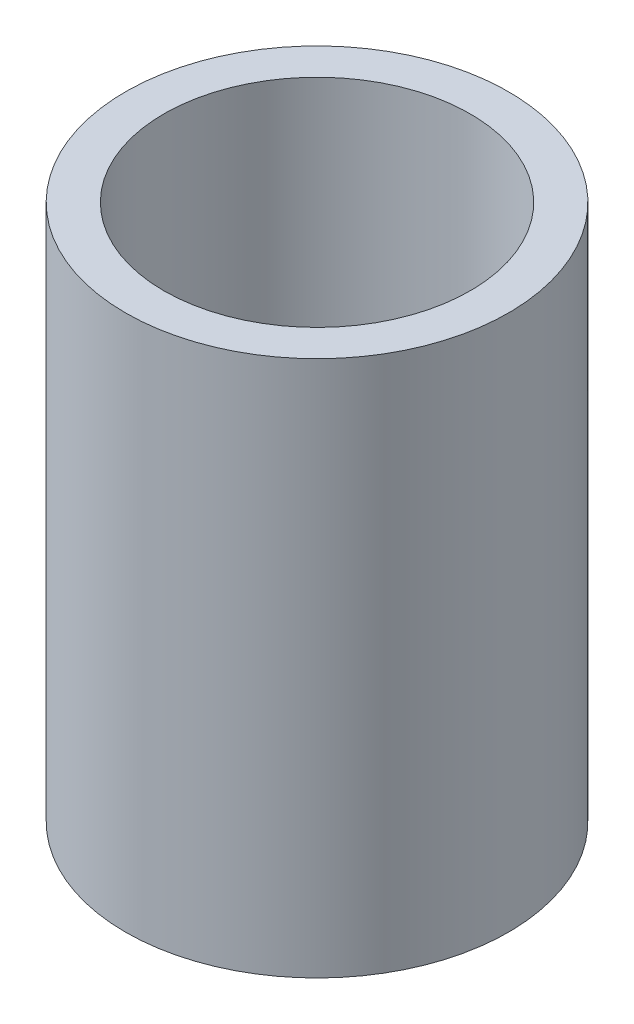
ISO-10303-21;
HEADER;
FILE_DESCRIPTION(('STEP AP214'),'2;1');
FILE_NAME('part.step','',(''),(''),'','','');
FILE_SCHEMA(('AUTOMOTIVE_DESIGN { 1 0 10303 214 1 1 1 1 }'));
ENDSEC;
DATA;
#1=APPLICATION_CONTEXT('core data for automotive mechanical design processes');
#2=APPLICATION_PROTOCOL_DEFINITION('international standard','automotive_design',2000,#1);
#3=PRODUCT_CONTEXT('',#1,'mechanical');
#4=PRODUCT('Part','Part','',(#3));
#5=PRODUCT_RELATED_PRODUCT_CATEGORY('part','',(#4));
#6=PRODUCT_DEFINITION_FORMATION('','',#4);
#7=PRODUCT_DEFINITION_CONTEXT('part definition',#1,'design');
#8=PRODUCT_DEFINITION('design','',#6,#7);
#9=PRODUCT_DEFINITION_SHAPE('','',#8);
#10=(LENGTH_UNIT() NAMED_UNIT(*) SI_UNIT(.MILLI.,.METRE.));
#11=(NAMED_UNIT(*) PLANE_ANGLE_UNIT() SI_UNIT($,.RADIAN.));
#12=(NAMED_UNIT(*) SI_UNIT($,.STERADIAN.) SOLID_ANGLE_UNIT());
#13=UNCERTAINTY_MEASURE_WITH_UNIT(LENGTH_MEASURE(1.E-05),#10,'distance_accuracy_value','');
#14=(GEOMETRIC_REPRESENTATION_CONTEXT(3) GLOBAL_UNCERTAINTY_ASSIGNED_CONTEXT((#13)) GLOBAL_UNIT_ASSIGNED_CONTEXT((#10,
#11,#12)) REPRESENTATION_CONTEXT('',''));
#15=CARTESIAN_POINT('',(0.,0.,0.));
#16=DIRECTION('',(0.,0.,1.));
#17=DIRECTION('',(1.,0.,0.));
#18=AXIS2_PLACEMENT_3D('',#15,#16,#17);
#19=CARTESIAN_POINT('',(0.,14.,0.));
#20=DIRECTION('',(0.,1.,0.));
#21=DIRECTION('',(0.,0.,1.));
#22=AXIS2_PLACEMENT_3D('',#19,#20,#21);
#23=PLANE('',#22);
#24=CARTESIAN_POINT('',(0.,14.,0.));
#25=DIRECTION('',(0.,1.,0.));
#26=DIRECTION('',(0.,0.,1.));
#27=AXIS2_PLACEMENT_3D('',#24,#25,#26);
#28=CIRCLE('',#27,5.);
#29=CARTESIAN_POINT('',(0.,14.,5.));
#30=VERTEX_POINT('',#29);
#31=EDGE_CURVE('E10',#30,#30,#28,.T.);
#32=ORIENTED_EDGE('',*,*,#31,.T.);
#33=EDGE_LOOP('',(#32));
#34=FACE_BOUND('',#33,.T.);
#35=CARTESIAN_POINT('',(0.,14.,0.));
#36=DIRECTION('',(0.,1.,0.));
#37=DIRECTION('',(0.,0.,1.));
#38=AXIS2_PLACEMENT_3D('',#35,#36,#37);
#39=CIRCLE('',#38,4.);
#40=CARTESIAN_POINT('',(0.,14.,4.));
#41=VERTEX_POINT('',#40);
#42=EDGE_CURVE('E41',#41,#41,#39,.T.);
#43=ORIENTED_EDGE('',*,*,#42,.F.);
#44=EDGE_LOOP('',(#43));
#45=FACE_BOUND('',#44,.T.);
#46=ADVANCED_FACE('F30',(#34,#45),#23,.T.);
#47=CARTESIAN_POINT('',(0.,0.,0.));
#48=DIRECTION('',(0.,1.,0.));
#49=DIRECTION('',(0.,0.,1.));
#50=AXIS2_PLACEMENT_3D('',#47,#48,#49);
#51=PLANE('',#50);
#52=CARTESIAN_POINT('',(0.,0.,0.));
#53=DIRECTION('',(0.,1.,0.));
#54=DIRECTION('',(0.,0.,1.));
#55=AXIS2_PLACEMENT_3D('',#52,#53,#54);
#56=CIRCLE('',#55,5.);
#57=CARTESIAN_POINT('',(0.,0.,5.));
#58=VERTEX_POINT('',#57);
#59=EDGE_CURVE('E34',#58,#58,#56,.T.);
#60=ORIENTED_EDGE('',*,*,#59,.F.);
#61=EDGE_LOOP('',(#60));
#62=FACE_BOUND('',#61,.T.);
#63=CARTESIAN_POINT('',(0.,0.,0.));
#64=DIRECTION('',(0.,1.,0.));
#65=DIRECTION('',(0.,0.,1.));
#66=AXIS2_PLACEMENT_3D('',#63,#64,#65);
#67=CIRCLE('',#66,4.);
#68=CARTESIAN_POINT('',(0.,0.,4.));
#69=VERTEX_POINT('',#68);
#70=EDGE_CURVE('E43',#69,#69,#67,.T.);
#71=ORIENTED_EDGE('',*,*,#70,.T.);
#72=EDGE_LOOP('',(#71));
#73=FACE_BOUND('',#72,.T.);
#74=ADVANCED_FACE('F53',(#62,#73),#51,.F.);
#75=CARTESIAN_POINT('',(0.,14.,0.));
#76=DIRECTION('',(0.,-1.,0.));
#77=DIRECTION('',(0.,0.,-1.));
#78=AXIS2_PLACEMENT_3D('',#75,#76,#77);
#79=CYLINDRICAL_SURFACE('',#78,5.);
#80=ORIENTED_EDGE('',*,*,#31,.F.);
#81=EDGE_LOOP('',(#80));
#82=FACE_BOUND('',#81,.T.);
#83=ORIENTED_EDGE('',*,*,#59,.T.);
#84=EDGE_LOOP('',(#83));
#85=FACE_BOUND('',#84,.T.);
#86=ADVANCED_FACE('F32',(#82,#85),#79,.T.);
#87=CARTESIAN_POINT('',(0.,14.,0.));
#88=DIRECTION('',(0.,-1.,0.));
#89=DIRECTION('',(0.,0.,-1.));
#90=AXIS2_PLACEMENT_3D('',#87,#88,#89);
#91=CYLINDRICAL_SURFACE('',#90,4.);
#92=ORIENTED_EDGE('',*,*,#42,.T.);
#93=EDGE_LOOP('',(#92));
#94=FACE_BOUND('',#93,.T.);
#95=ORIENTED_EDGE('',*,*,#70,.F.);
#96=EDGE_LOOP('',(#95));
#97=FACE_BOUND('',#96,.T.);
#98=ADVANCED_FACE('F49',(#94,#97),#91,.F.);
#99=CLOSED_SHELL('',(#46,#74,#86,#98));
#100=MANIFOLD_SOLID_BREP('B2',#99);
#101=ADVANCED_BREP_SHAPE_REPRESENTATION('',(#18,#100),#14);
#102=SHAPE_DEFINITION_REPRESENTATION(#9,#101);
ENDSEC;
END-ISO-10303-21;
